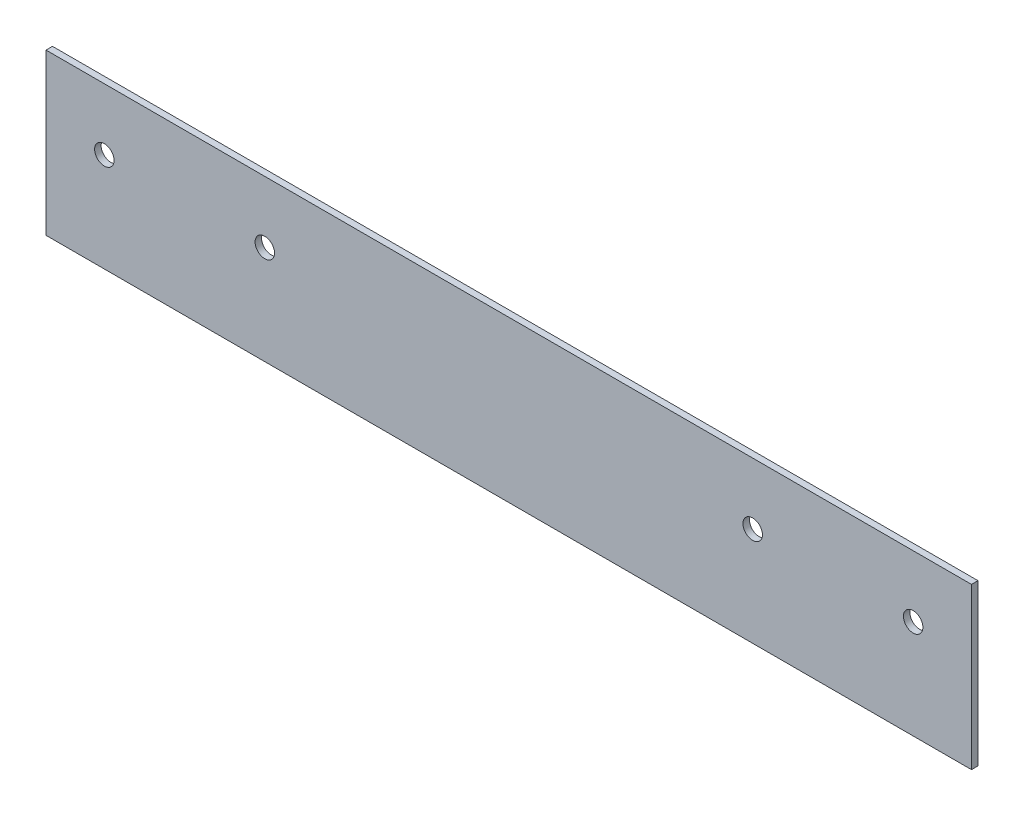
ISO-10303-21;
HEADER;
FILE_DESCRIPTION(('STEP AP214'),'2;1');
FILE_NAME('part.step','',(''),(''),'','','');
FILE_SCHEMA(('AUTOMOTIVE_DESIGN { 1 0 10303 214 1 1 1 1 }'));
ENDSEC;
DATA;
#1=APPLICATION_CONTEXT('core data for automotive mechanical design processes');
#2=APPLICATION_PROTOCOL_DEFINITION('international standard','automotive_design',2000,#1);
#3=PRODUCT_CONTEXT('',#1,'mechanical');
#4=PRODUCT('Part','Part','',(#3));
#5=PRODUCT_RELATED_PRODUCT_CATEGORY('part','',(#4));
#6=PRODUCT_DEFINITION_FORMATION('','',#4);
#7=PRODUCT_DEFINITION_CONTEXT('part definition',#1,'design');
#8=PRODUCT_DEFINITION('design','',#6,#7);
#9=PRODUCT_DEFINITION_SHAPE('','',#8);
#10=(LENGTH_UNIT() NAMED_UNIT(*) SI_UNIT(.MILLI.,.METRE.));
#11=(NAMED_UNIT(*) PLANE_ANGLE_UNIT() SI_UNIT($,.RADIAN.));
#12=(NAMED_UNIT(*) SI_UNIT($,.STERADIAN.) SOLID_ANGLE_UNIT());
#13=UNCERTAINTY_MEASURE_WITH_UNIT(LENGTH_MEASURE(1.E-05),#10,'distance_accuracy_value','');
#14=(GEOMETRIC_REPRESENTATION_CONTEXT(3) GLOBAL_UNCERTAINTY_ASSIGNED_CONTEXT((#13)) GLOBAL_UNIT_ASSIGNED_CONTEXT((#10,
#11,#12)) REPRESENTATION_CONTEXT('',''));
#15=CARTESIAN_POINT('',(0.,0.,0.));
#16=DIRECTION('',(0.,0.,1.));
#17=DIRECTION('',(1.,0.,0.));
#18=AXIS2_PLACEMENT_3D('',#15,#16,#17);
#19=CARTESIAN_POINT('',(0.,0.,2.));
#20=DIRECTION('',(0.,0.,-1.));
#21=DIRECTION('',(-1.,0.,0.));
#22=AXIS2_PLACEMENT_3D('',#19,#20,#21);
#23=PLANE('',#22);
#24=DIRECTION('',(-1.,0.,0.));
#25=VECTOR('',#24,1.);
#26=CARTESIAN_POINT('',(-142.75,49.5,2.));
#27=LINE('',#26,#25);
#28=CARTESIAN_POINT('',(142.75,49.5,2.));
#29=VERTEX_POINT('',#28);
#30=CARTESIAN_POINT('',(-142.75,49.5,2.));
#31=VERTEX_POINT('',#30);
#32=EDGE_CURVE('E83',#29,#31,#27,.T.);
#33=ORIENTED_EDGE('',*,*,#32,.T.);
#34=DIRECTION('',(0.,-1.,0.));
#35=VECTOR('',#34,1.);
#36=CARTESIAN_POINT('',(-142.75,49.5,2.));
#37=LINE('',#36,#35);
#38=CARTESIAN_POINT('',(-142.75,0.,2.));
#39=VERTEX_POINT('',#38);
#40=EDGE_CURVE('E78',#31,#39,#37,.T.);
#41=ORIENTED_EDGE('',*,*,#40,.T.);
#42=DIRECTION('',(1.,0.,0.));
#43=VECTOR('',#42,1.);
#44=CARTESIAN_POINT('',(-142.75,0.,2.));
#45=LINE('',#44,#43);
#46=CARTESIAN_POINT('',(142.75,0.,2.));
#47=VERTEX_POINT('',#46);
#48=EDGE_CURVE('E81',#39,#47,#45,.T.);
#49=ORIENTED_EDGE('',*,*,#48,.T.);
#50=DIRECTION('',(0.,1.,0.));
#51=VECTOR('',#50,1.);
#52=CARTESIAN_POINT('',(142.75,49.5,2.));
#53=LINE('',#52,#51);
#54=EDGE_CURVE('E49',#47,#29,#53,.T.);
#55=ORIENTED_EDGE('',*,*,#54,.T.);
#56=EDGE_LOOP('',(#33,#41,#49,#55));
#57=FACE_BOUND('',#56,.T.);
#58=CARTESIAN_POINT('',(124.75,30.5,2.));
#59=DIRECTION('',(0.,0.,1.));
#60=DIRECTION('',(1.,0.,0.));
#61=AXIS2_PLACEMENT_3D('',#58,#59,#60);
#62=CIRCLE('',#61,2.99999999999998);
#63=CARTESIAN_POINT('',(127.75,30.5,2.));
#64=VERTEX_POINT('',#63);
#65=EDGE_CURVE('E99',#64,#64,#62,.T.);
#66=ORIENTED_EDGE('',*,*,#65,.F.);
#67=EDGE_LOOP('',(#66));
#68=FACE_BOUND('',#67,.T.);
#69=CARTESIAN_POINT('',(-75.25,30.5,2.));
#70=DIRECTION('',(0.,0.,1.));
#71=DIRECTION('',(1.,0.,0.));
#72=AXIS2_PLACEMENT_3D('',#69,#70,#71);
#73=CIRCLE('',#72,2.99999999999999);
#74=CARTESIAN_POINT('',(-72.25,30.5,2.));
#75=VERTEX_POINT('',#74);
#76=EDGE_CURVE('E114',#75,#75,#73,.T.);
#77=ORIENTED_EDGE('',*,*,#76,.F.);
#78=EDGE_LOOP('',(#77));
#79=FACE_BOUND('',#78,.T.);
#80=CARTESIAN_POINT('',(75.25,30.5,2.));
#81=DIRECTION('',(0.,0.,1.));
#82=DIRECTION('',(-1.,0.,0.));
#83=AXIS2_PLACEMENT_3D('',#80,#81,#82);
#84=CIRCLE('',#83,2.99999999999999);
#85=CARTESIAN_POINT('',(72.25,30.5,2.));
#86=VERTEX_POINT('',#85);
#87=EDGE_CURVE('E120',#86,#86,#84,.T.);
#88=ORIENTED_EDGE('',*,*,#87,.F.);
#89=EDGE_LOOP('',(#88));
#90=FACE_BOUND('',#89,.T.);
#91=CARTESIAN_POINT('',(-124.75,30.5,2.));
#92=DIRECTION('',(0.,0.,1.));
#93=DIRECTION('',(-1.,0.,0.));
#94=AXIS2_PLACEMENT_3D('',#91,#92,#93);
#95=CIRCLE('',#94,2.99999999999998);
#96=CARTESIAN_POINT('',(-127.75,30.5,2.));
#97=VERTEX_POINT('',#96);
#98=EDGE_CURVE('E126',#97,#97,#95,.T.);
#99=ORIENTED_EDGE('',*,*,#98,.F.);
#100=EDGE_LOOP('',(#99));
#101=FACE_BOUND('',#100,.T.);
#102=ADVANCED_FACE('F32',(#57,#68,#79,#90,#101),#23,.F.);
#103=CARTESIAN_POINT('',(0.,0.,0.));
#104=DIRECTION('',(0.,0.,-1.));
#105=DIRECTION('',(-1.,0.,0.));
#106=AXIS2_PLACEMENT_3D('',#103,#104,#105);
#107=PLANE('',#106);
#108=CARTESIAN_POINT('',(75.25,30.5,0.));
#109=DIRECTION('',(0.,0.,1.));
#110=DIRECTION('',(-1.,0.,0.));
#111=AXIS2_PLACEMENT_3D('',#108,#109,#110);
#112=CIRCLE('',#111,2.99999999999999);
#113=CARTESIAN_POINT('',(72.25,30.5,0.));
#114=VERTEX_POINT('',#113);
#115=EDGE_CURVE('E123',#114,#114,#112,.T.);
#116=ORIENTED_EDGE('',*,*,#115,.T.);
#117=EDGE_LOOP('',(#116));
#118=FACE_BOUND('',#117,.T.);
#119=CARTESIAN_POINT('',(124.75,30.5,0.));
#120=DIRECTION('',(0.,0.,1.));
#121=DIRECTION('',(1.,0.,0.));
#122=AXIS2_PLACEMENT_3D('',#119,#120,#121);
#123=CIRCLE('',#122,2.99999999999998);
#124=CARTESIAN_POINT('',(127.75,30.5,0.));
#125=VERTEX_POINT('',#124);
#126=EDGE_CURVE('E111',#125,#125,#123,.T.);
#127=ORIENTED_EDGE('',*,*,#126,.T.);
#128=EDGE_LOOP('',(#127));
#129=FACE_BOUND('',#128,.T.);
#130=DIRECTION('',(-1.,0.,0.));
#131=VECTOR('',#130,1.);
#132=CARTESIAN_POINT('',(-142.75,49.5,0.));
#133=LINE('',#132,#131);
#134=CARTESIAN_POINT('',(142.75,49.5,0.));
#135=VERTEX_POINT('',#134);
#136=CARTESIAN_POINT('',(-142.75,49.5,0.));
#137=VERTEX_POINT('',#136);
#138=EDGE_CURVE('E96',#135,#137,#133,.T.);
#139=ORIENTED_EDGE('',*,*,#138,.F.);
#140=DIRECTION('',(0.,1.,0.));
#141=VECTOR('',#140,1.);
#142=CARTESIAN_POINT('',(142.75,49.5,0.));
#143=LINE('',#142,#141);
#144=CARTESIAN_POINT('',(142.75,0.,0.));
#145=VERTEX_POINT('',#144);
#146=EDGE_CURVE('E71',#145,#135,#143,.T.);
#147=ORIENTED_EDGE('',*,*,#146,.F.);
#148=DIRECTION('',(1.,0.,0.));
#149=VECTOR('',#148,1.);
#150=CARTESIAN_POINT('',(142.75,0.,0.));
#151=LINE('',#150,#149);
#152=CARTESIAN_POINT('',(-142.75,0.,0.));
#153=VERTEX_POINT('',#152);
#154=EDGE_CURVE('E65',#153,#145,#151,.T.);
#155=ORIENTED_EDGE('',*,*,#154,.F.);
#156=DIRECTION('',(0.,-1.,0.));
#157=VECTOR('',#156,1.);
#158=CARTESIAN_POINT('',(-142.75,49.5,0.));
#159=LINE('',#158,#157);
#160=EDGE_CURVE('E88',#137,#153,#159,.T.);
#161=ORIENTED_EDGE('',*,*,#160,.F.);
#162=EDGE_LOOP('',(#139,#147,#155,#161));
#163=FACE_BOUND('',#162,.T.);
#164=CARTESIAN_POINT('',(-75.25,30.5,0.));
#165=DIRECTION('',(0.,0.,1.));
#166=DIRECTION('',(1.,0.,0.));
#167=AXIS2_PLACEMENT_3D('',#164,#165,#166);
#168=CIRCLE('',#167,2.99999999999999);
#169=CARTESIAN_POINT('',(-72.25,30.5,0.));
#170=VERTEX_POINT('',#169);
#171=EDGE_CURVE('E117',#170,#170,#168,.T.);
#172=ORIENTED_EDGE('',*,*,#171,.T.);
#173=EDGE_LOOP('',(#172));
#174=FACE_BOUND('',#173,.T.);
#175=CARTESIAN_POINT('',(-124.75,30.5,0.));
#176=DIRECTION('',(0.,0.,1.));
#177=DIRECTION('',(-1.,0.,0.));
#178=AXIS2_PLACEMENT_3D('',#175,#176,#177);
#179=CIRCLE('',#178,2.99999999999998);
#180=CARTESIAN_POINT('',(-127.75,30.5,0.));
#181=VERTEX_POINT('',#180);
#182=EDGE_CURVE('E129',#181,#181,#179,.T.);
#183=ORIENTED_EDGE('',*,*,#182,.T.);
#184=EDGE_LOOP('',(#183));
#185=FACE_BOUND('',#184,.T.);
#186=ADVANCED_FACE('F107',(#118,#129,#163,#174,#185),#107,.T.);
#187=CARTESIAN_POINT('',(-142.75,49.5,2.));
#188=DIRECTION('',(0.,-1.,0.));
#189=DIRECTION('',(1.,0.,0.));
#190=AXIS2_PLACEMENT_3D('',#187,#188,#189);
#191=PLANE('',#190);
#192=ORIENTED_EDGE('',*,*,#138,.T.);
#193=DIRECTION('',(0.,0.,-1.));
#194=VECTOR('',#193,1.);
#195=CARTESIAN_POINT('',(-142.75,49.5,2.));
#196=LINE('',#195,#194);
#197=EDGE_CURVE('E11',#31,#137,#196,.T.);
#198=ORIENTED_EDGE('',*,*,#197,.F.);
#199=ORIENTED_EDGE('',*,*,#32,.F.);
#200=DIRECTION('',(0.,0.,-1.));
#201=VECTOR('',#200,1.);
#202=CARTESIAN_POINT('',(142.75,49.5,2.));
#203=LINE('',#202,#201);
#204=EDGE_CURVE('E92',#29,#135,#203,.T.);
#205=ORIENTED_EDGE('',*,*,#204,.T.);
#206=EDGE_LOOP('',(#192,#198,#199,#205));
#207=FACE_BOUND('',#206,.T.);
#208=ADVANCED_FACE('F34',(#207),#191,.F.);
#209=CARTESIAN_POINT('',(-142.75,49.5,2.));
#210=DIRECTION('',(1.,0.,0.));
#211=DIRECTION('',(0.,0.,-1.));
#212=AXIS2_PLACEMENT_3D('',#209,#210,#211);
#213=PLANE('',#212);
#214=ORIENTED_EDGE('',*,*,#160,.T.);
#215=DIRECTION('',(0.,0.,-1.));
#216=VECTOR('',#215,1.);
#217=CARTESIAN_POINT('',(-142.75,0.,2.));
#218=LINE('',#217,#216);
#219=EDGE_CURVE('E41',#39,#153,#218,.T.);
#220=ORIENTED_EDGE('',*,*,#219,.F.);
#221=ORIENTED_EDGE('',*,*,#40,.F.);
#222=ORIENTED_EDGE('',*,*,#197,.T.);
#223=EDGE_LOOP('',(#214,#220,#221,#222));
#224=FACE_BOUND('',#223,.T.);
#225=ADVANCED_FACE('F87',(#224),#213,.F.);
#226=CARTESIAN_POINT('',(142.75,0.,2.));
#227=DIRECTION('',(0.,1.,0.));
#228=DIRECTION('',(-1.,0.,0.));
#229=AXIS2_PLACEMENT_3D('',#226,#227,#228);
#230=PLANE('',#229);
#231=ORIENTED_EDGE('',*,*,#154,.T.);
#232=DIRECTION('',(0.,0.,-1.));
#233=VECTOR('',#232,1.);
#234=CARTESIAN_POINT('',(142.75,0.,2.));
#235=LINE('',#234,#233);
#236=EDGE_CURVE('E89',#47,#145,#235,.T.);
#237=ORIENTED_EDGE('',*,*,#236,.F.);
#238=ORIENTED_EDGE('',*,*,#48,.F.);
#239=ORIENTED_EDGE('',*,*,#219,.T.);
#240=EDGE_LOOP('',(#231,#237,#238,#239));
#241=FACE_BOUND('',#240,.T.);
#242=ADVANCED_FACE('F90',(#241),#230,.F.);
#243=CARTESIAN_POINT('',(142.75,49.5,2.));
#244=DIRECTION('',(-1.,0.,0.));
#245=DIRECTION('',(0.,0.,1.));
#246=AXIS2_PLACEMENT_3D('',#243,#244,#245);
#247=PLANE('',#246);
#248=ORIENTED_EDGE('',*,*,#146,.T.);
#249=ORIENTED_EDGE('',*,*,#204,.F.);
#250=ORIENTED_EDGE('',*,*,#54,.F.);
#251=ORIENTED_EDGE('',*,*,#236,.T.);
#252=EDGE_LOOP('',(#248,#249,#250,#251));
#253=FACE_BOUND('',#252,.T.);
#254=ADVANCED_FACE('F104',(#253),#247,.F.);
#255=CARTESIAN_POINT('',(124.75,30.5,2.));
#256=DIRECTION('',(0.,0.,-1.));
#257=DIRECTION('',(-1.,0.,0.));
#258=AXIS2_PLACEMENT_3D('',#255,#256,#257);
#259=CYLINDRICAL_SURFACE('',#258,2.99999999999998);
#260=ORIENTED_EDGE('',*,*,#65,.T.);
#261=EDGE_LOOP('',(#260));
#262=FACE_BOUND('',#261,.T.);
#263=ORIENTED_EDGE('',*,*,#126,.F.);
#264=EDGE_LOOP('',(#263));
#265=FACE_BOUND('',#264,.T.);
#266=ADVANCED_FACE('F146',(#262,#265),#259,.F.);
#267=CARTESIAN_POINT('',(-75.25,30.5,2.));
#268=DIRECTION('',(0.,0.,-1.));
#269=DIRECTION('',(-1.,0.,0.));
#270=AXIS2_PLACEMENT_3D('',#267,#268,#269);
#271=CYLINDRICAL_SURFACE('',#270,2.99999999999999);
#272=ORIENTED_EDGE('',*,*,#76,.T.);
#273=EDGE_LOOP('',(#272));
#274=FACE_BOUND('',#273,.T.);
#275=ORIENTED_EDGE('',*,*,#171,.F.);
#276=EDGE_LOOP('',(#275));
#277=FACE_BOUND('',#276,.T.);
#278=ADVANCED_FACE('F195',(#274,#277),#271,.F.);
#279=CARTESIAN_POINT('',(75.25,30.5,2.));
#280=DIRECTION('',(0.,0.,-1.));
#281=DIRECTION('',(-1.,0.,0.));
#282=AXIS2_PLACEMENT_3D('',#279,#280,#281);
#283=CYLINDRICAL_SURFACE('',#282,2.99999999999999);
#284=ORIENTED_EDGE('',*,*,#87,.T.);
#285=EDGE_LOOP('',(#284));
#286=FACE_BOUND('',#285,.T.);
#287=ORIENTED_EDGE('',*,*,#115,.F.);
#288=EDGE_LOOP('',(#287));
#289=FACE_BOUND('',#288,.T.);
#290=ADVANCED_FACE('F203',(#286,#289),#283,.F.);
#291=CARTESIAN_POINT('',(-124.75,30.5,2.));
#292=DIRECTION('',(0.,0.,-1.));
#293=DIRECTION('',(-1.,0.,0.));
#294=AXIS2_PLACEMENT_3D('',#291,#292,#293);
#295=CYLINDRICAL_SURFACE('',#294,2.99999999999998);
#296=ORIENTED_EDGE('',*,*,#98,.T.);
#297=EDGE_LOOP('',(#296));
#298=FACE_BOUND('',#297,.T.);
#299=ORIENTED_EDGE('',*,*,#182,.F.);
#300=EDGE_LOOP('',(#299));
#301=FACE_BOUND('',#300,.T.);
#302=ADVANCED_FACE('F135',(#298,#301),#295,.F.);
#303=CLOSED_SHELL('',(#102,#186,#208,#225,#242,#254,#266,#278,#290,#302));
#304=MANIFOLD_SOLID_BREP('B2',#303);
#305=ADVANCED_BREP_SHAPE_REPRESENTATION('',(#18,#304),#14);
#306=SHAPE_DEFINITION_REPRESENTATION(#9,#305);
ENDSEC;
END-ISO-10303-21;
